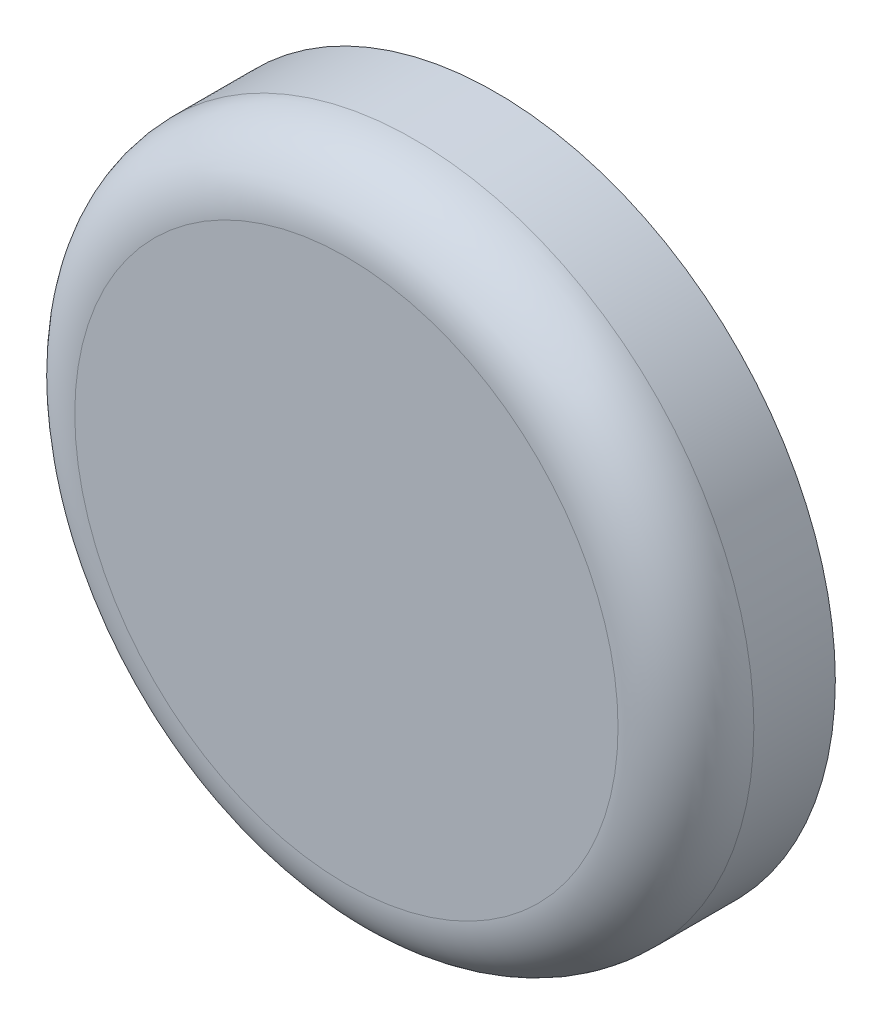
ISO-10303-21;
HEADER;
FILE_DESCRIPTION(('STEP AP214'),'2;1');
FILE_NAME('part.step','',(''),(''),'','','');
FILE_SCHEMA(('AUTOMOTIVE_DESIGN { 1 0 10303 214 1 1 1 1 }'));
ENDSEC;
DATA;
#1=APPLICATION_CONTEXT('core data for automotive mechanical design processes');
#2=APPLICATION_PROTOCOL_DEFINITION('international standard','automotive_design',2000,#1);
#3=PRODUCT_CONTEXT('',#1,'mechanical');
#4=PRODUCT('Part','Part','',(#3));
#5=PRODUCT_RELATED_PRODUCT_CATEGORY('part','',(#4));
#6=PRODUCT_DEFINITION_FORMATION('','',#4);
#7=PRODUCT_DEFINITION_CONTEXT('part definition',#1,'design');
#8=PRODUCT_DEFINITION('design','',#6,#7);
#9=PRODUCT_DEFINITION_SHAPE('','',#8);
#10=(LENGTH_UNIT() NAMED_UNIT(*) SI_UNIT(.MILLI.,.METRE.));
#11=(NAMED_UNIT(*) PLANE_ANGLE_UNIT() SI_UNIT($,.RADIAN.));
#12=(NAMED_UNIT(*) SI_UNIT($,.STERADIAN.) SOLID_ANGLE_UNIT());
#13=UNCERTAINTY_MEASURE_WITH_UNIT(LENGTH_MEASURE(1.E-05),#10,'distance_accuracy_value','');
#14=(GEOMETRIC_REPRESENTATION_CONTEXT(3) GLOBAL_UNCERTAINTY_ASSIGNED_CONTEXT((#13)) GLOBAL_UNIT_ASSIGNED_CONTEXT((#10,
#11,#12)) REPRESENTATION_CONTEXT('',''));
#15=CARTESIAN_POINT('',(0.,0.,0.));
#16=DIRECTION('',(0.,0.,1.));
#17=DIRECTION('',(1.,0.,0.));
#18=AXIS2_PLACEMENT_3D('',#15,#16,#17);
#19=CARTESIAN_POINT('',(-5.625,13.75,11.));
#20=DIRECTION('',(0.,0.,-1.));
#21=DIRECTION('',(-1.,0.,0.));
#22=AXIS2_PLACEMENT_3D('',#19,#20,#21);
#23=CYLINDRICAL_SURFACE('',#22,25.);
#24=CARTESIAN_POINT('',(-5.625,13.75,6.));
#25=DIRECTION('',(0.,0.,1.));
#26=DIRECTION('',(1.,0.,0.));
#27=AXIS2_PLACEMENT_3D('',#24,#25,#26);
#28=CIRCLE('',#27,25.);
#29=CARTESIAN_POINT('',(19.375,13.75,6.));
#30=VERTEX_POINT('',#29);
#31=EDGE_CURVE('E10',#30,#30,#28,.F.);
#32=ORIENTED_EDGE('',*,*,#31,.T.);
#33=EDGE_LOOP('',(#32));
#34=FACE_BOUND('',#33,.T.);
#35=CARTESIAN_POINT('',(-5.625,13.75,0.));
#36=DIRECTION('',(0.,0.,1.));
#37=DIRECTION('',(1.,0.,0.));
#38=AXIS2_PLACEMENT_3D('',#35,#36,#37);
#39=CIRCLE('',#38,25.);
#40=CARTESIAN_POINT('',(19.375,13.75,0.));
#41=VERTEX_POINT('',#40);
#42=EDGE_CURVE('E42',#41,#41,#39,.T.);
#43=ORIENTED_EDGE('',*,*,#42,.T.);
#44=EDGE_LOOP('',(#43));
#45=FACE_BOUND('',#44,.T.);
#46=ADVANCED_FACE('F30',(#34,#45),#23,.T.);
#47=CARTESIAN_POINT('',(-5.625,13.75,11.));
#48=DIRECTION('',(0.,0.,1.));
#49=DIRECTION('',(1.,0.,0.));
#50=AXIS2_PLACEMENT_3D('',#47,#48,#49);
#51=PLANE('',#50);
#52=CARTESIAN_POINT('',(-5.625,13.75,11.));
#53=DIRECTION('',(0.,0.,1.));
#54=DIRECTION('',(1.,0.,0.));
#55=AXIS2_PLACEMENT_3D('',#52,#53,#54);
#56=CIRCLE('',#55,20.);
#57=CARTESIAN_POINT('',(14.375,13.75,11.));
#58=VERTEX_POINT('',#57);
#59=EDGE_CURVE('E38',#58,#58,#56,.T.);
#60=ORIENTED_EDGE('',*,*,#59,.T.);
#61=EDGE_LOOP('',(#60));
#62=FACE_BOUND('',#61,.T.);
#63=ADVANCED_FACE('F76',(#62),#51,.T.);
#64=CARTESIAN_POINT('',(-5.625,13.75,0.));
#65=DIRECTION('',(0.,0.,1.));
#66=DIRECTION('',(1.,0.,0.));
#67=AXIS2_PLACEMENT_3D('',#64,#65,#66);
#68=PLANE('',#67);
#69=CARTESIAN_POINT('',(-5.625,13.75,0.));
#70=DIRECTION('',(0.,0.,-1.));
#71=DIRECTION('',(-1.,0.,0.));
#72=AXIS2_PLACEMENT_3D('',#69,#70,#71);
#73=CIRCLE('',#72,7.);
#74=CARTESIAN_POINT('',(-12.625,13.75,0.));
#75=VERTEX_POINT('',#74);
#76=EDGE_CURVE('E50',#75,#75,#73,.T.);
#77=ORIENTED_EDGE('',*,*,#76,.F.);
#78=EDGE_LOOP('',(#77));
#79=FACE_BOUND('',#78,.T.);
#80=ORIENTED_EDGE('',*,*,#42,.F.);
#81=EDGE_LOOP('',(#80));
#82=FACE_BOUND('',#81,.T.);
#83=ADVANCED_FACE('F80',(#79,#82),#68,.F.);
#84=CARTESIAN_POINT('',(-5.625,13.75,6.));
#85=DIRECTION('',(0.,0.,1.));
#86=DIRECTION('',(1.,0.,0.));
#87=AXIS2_PLACEMENT_3D('',#84,#85,#86);
#88=TOROIDAL_SURFACE('',#87,20.,5.);
#89=ORIENTED_EDGE('',*,*,#31,.F.);
#90=EDGE_LOOP('',(#89));
#91=FACE_BOUND('',#90,.T.);
#92=ORIENTED_EDGE('',*,*,#59,.F.);
#93=EDGE_LOOP('',(#92));
#94=FACE_BOUND('',#93,.T.);
#95=ADVANCED_FACE('F32',(#91,#94),#88,.T.);
#96=CARTESIAN_POINT('',(-5.625,13.75,4.5));
#97=DIRECTION('',(0.,0.,-1.));
#98=DIRECTION('',(-1.,0.,0.));
#99=AXIS2_PLACEMENT_3D('',#96,#97,#98);
#100=PLANE('',#99);
#101=CARTESIAN_POINT('',(-5.625,13.75,4.5));
#102=DIRECTION('',(0.,0.,-1.));
#103=DIRECTION('',(-1.,0.,0.));
#104=AXIS2_PLACEMENT_3D('',#101,#102,#103);
#105=CIRCLE('',#104,7.);
#106=CARTESIAN_POINT('',(-12.625,13.75,4.5));
#107=VERTEX_POINT('',#106);
#108=EDGE_CURVE('E53',#107,#107,#105,.T.);
#109=ORIENTED_EDGE('',*,*,#108,.T.);
#110=EDGE_LOOP('',(#109));
#111=FACE_BOUND('',#110,.T.);
#112=CARTESIAN_POINT('',(-5.625,13.75,4.5));
#113=DIRECTION('',(0.,0.,-1.));
#114=DIRECTION('',(-1.,0.,0.));
#115=AXIS2_PLACEMENT_3D('',#112,#113,#114);
#116=CIRCLE('',#115,5.875);
#117=CARTESIAN_POINT('',(-11.5,13.75,4.5));
#118=VERTEX_POINT('',#117);
#119=EDGE_CURVE('E34',#118,#118,#116,.F.);
#120=ORIENTED_EDGE('',*,*,#119,.T.);
#121=EDGE_LOOP('',(#120));
#122=FACE_BOUND('',#121,.T.);
#123=ADVANCED_FACE('F60',(#111,#122),#100,.T.);
#124=CARTESIAN_POINT('',(-5.625,13.75,4.5));
#125=DIRECTION('',(0.,0.,-1.));
#126=DIRECTION('',(-1.,0.,0.));
#127=AXIS2_PLACEMENT_3D('',#124,#125,#126);
#128=CYLINDRICAL_SURFACE('',#127,7.);
#129=ORIENTED_EDGE('',*,*,#108,.F.);
#130=EDGE_LOOP('',(#129));
#131=FACE_BOUND('',#130,.T.);
#132=ORIENTED_EDGE('',*,*,#76,.T.);
#133=EDGE_LOOP('',(#132));
#134=FACE_BOUND('',#133,.T.);
#135=ADVANCED_FACE('F70',(#131,#134),#128,.F.);
#136=CARTESIAN_POINT('',(-5.625,13.75,9.));
#137=DIRECTION('',(0.,0.,-1.));
#138=DIRECTION('',(-1.,0.,0.));
#139=AXIS2_PLACEMENT_3D('',#136,#137,#138);
#140=PLANE('',#139);
#141=CARTESIAN_POINT('',(-5.625,13.75,9.));
#142=DIRECTION('',(0.,0.,-1.));
#143=DIRECTION('',(-1.,0.,0.));
#144=AXIS2_PLACEMENT_3D('',#141,#142,#143);
#145=CIRCLE('',#144,5.875);
#146=CARTESIAN_POINT('',(-11.5,13.75,9.));
#147=VERTEX_POINT('',#146);
#148=EDGE_CURVE('E47',#147,#147,#145,.T.);
#149=ORIENTED_EDGE('',*,*,#148,.T.);
#150=EDGE_LOOP('',(#149));
#151=FACE_BOUND('',#150,.T.);
#152=ADVANCED_FACE('F64',(#151),#140,.T.);
#153=CARTESIAN_POINT('',(-5.625,13.75,9.));
#154=DIRECTION('',(0.,0.,-1.));
#155=DIRECTION('',(-1.,0.,0.));
#156=AXIS2_PLACEMENT_3D('',#153,#154,#155);
#157=CYLINDRICAL_SURFACE('',#156,5.875);
#158=ORIENTED_EDGE('',*,*,#148,.F.);
#159=EDGE_LOOP('',(#158));
#160=FACE_BOUND('',#159,.T.);
#161=ORIENTED_EDGE('',*,*,#119,.F.);
#162=EDGE_LOOP('',(#161));
#163=FACE_BOUND('',#162,.T.);
#164=ADVANCED_FACE('F62',(#160,#163),#157,.F.);
#165=CLOSED_SHELL('',(#46,#63,#83,#95,#123,#135,#152,#164));
#166=MANIFOLD_SOLID_BREP('B2',#165);
#167=ADVANCED_BREP_SHAPE_REPRESENTATION('',(#18,#166),#14);
#168=SHAPE_DEFINITION_REPRESENTATION(#9,#167);
ENDSEC;
END-ISO-10303-21;
